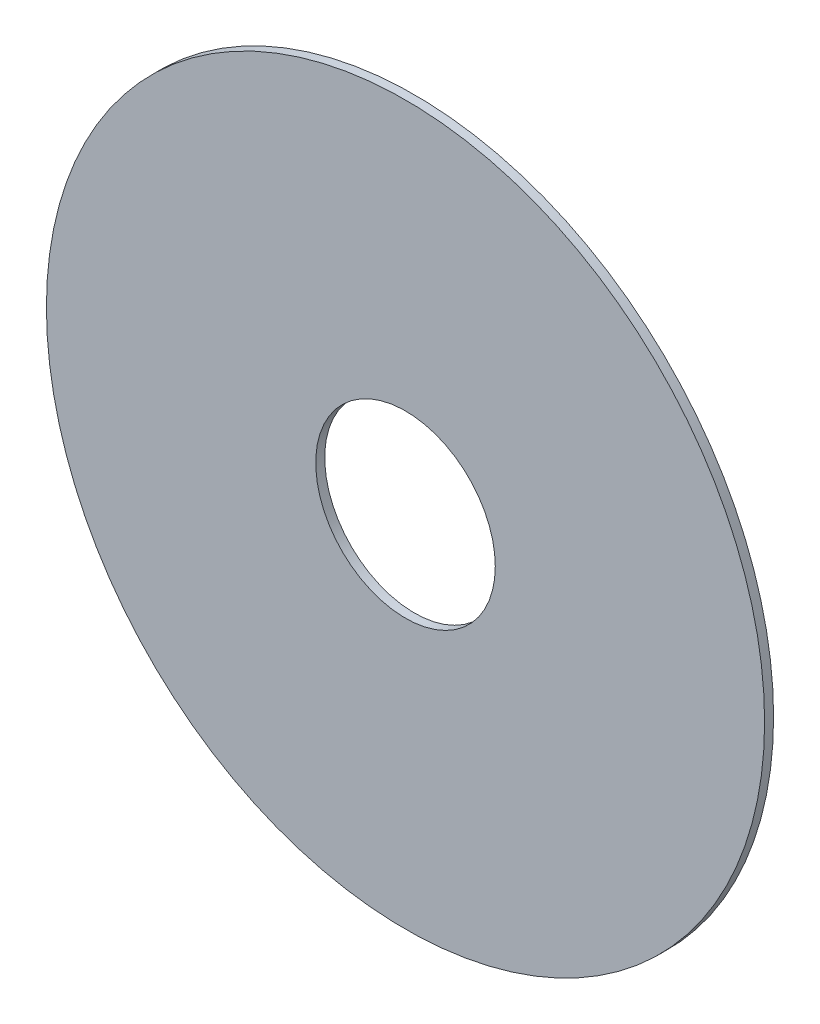
ISO-10303-21;
HEADER;
FILE_DESCRIPTION(('STEP AP214'),'2;1');
FILE_NAME('part.step','',(''),(''),'','','');
FILE_SCHEMA(('AUTOMOTIVE_DESIGN { 1 0 10303 214 1 1 1 1 }'));
ENDSEC;
DATA;
#1=APPLICATION_CONTEXT('core data for automotive mechanical design processes');
#2=APPLICATION_PROTOCOL_DEFINITION('international standard','automotive_design',2000,#1);
#3=PRODUCT_CONTEXT('',#1,'mechanical');
#4=PRODUCT('Part','Part','',(#3));
#5=PRODUCT_RELATED_PRODUCT_CATEGORY('part','',(#4));
#6=PRODUCT_DEFINITION_FORMATION('','',#4);
#7=PRODUCT_DEFINITION_CONTEXT('part definition',#1,'design');
#8=PRODUCT_DEFINITION('design','',#6,#7);
#9=PRODUCT_DEFINITION_SHAPE('','',#8);
#10=(LENGTH_UNIT() NAMED_UNIT(*) SI_UNIT(.MILLI.,.METRE.));
#11=(NAMED_UNIT(*) PLANE_ANGLE_UNIT() SI_UNIT($,.RADIAN.));
#12=(NAMED_UNIT(*) SI_UNIT($,.STERADIAN.) SOLID_ANGLE_UNIT());
#13=UNCERTAINTY_MEASURE_WITH_UNIT(LENGTH_MEASURE(1.E-05),#10,'distance_accuracy_value','');
#14=(GEOMETRIC_REPRESENTATION_CONTEXT(3) GLOBAL_UNCERTAINTY_ASSIGNED_CONTEXT((#13)) GLOBAL_UNIT_ASSIGNED_CONTEXT((#10,
#11,#12)) REPRESENTATION_CONTEXT('',''));
#15=CARTESIAN_POINT('',(0.,0.,0.));
#16=DIRECTION('',(0.,0.,1.));
#17=DIRECTION('',(1.,0.,0.));
#18=AXIS2_PLACEMENT_3D('',#15,#16,#17);
#19=CARTESIAN_POINT('',(0.,0.,0.5));
#20=DIRECTION('',(0.,0.,1.));
#21=DIRECTION('',(1.,0.,0.));
#22=AXIS2_PLACEMENT_3D('',#19,#20,#21);
#23=PLANE('',#22);
#24=CARTESIAN_POINT('',(0.,0.,0.5));
#25=DIRECTION('',(0.,0.,1.));
#26=DIRECTION('',(1.,0.,0.));
#27=AXIS2_PLACEMENT_3D('',#24,#25,#26);
#28=CIRCLE('',#27,5.);
#29=CARTESIAN_POINT('',(5.,0.,0.5));
#30=VERTEX_POINT('',#29);
#31=EDGE_CURVE('E27',#30,#30,#28,.F.);
#32=ORIENTED_EDGE('',*,*,#31,.T.);
#33=EDGE_LOOP('',(#32));
#34=FACE_BOUND('',#33,.T.);
#35=CARTESIAN_POINT('',(0.,0.,0.5));
#36=DIRECTION('',(0.,0.,1.));
#37=DIRECTION('',(1.,0.,0.));
#38=AXIS2_PLACEMENT_3D('',#35,#36,#37);
#39=CIRCLE('',#38,20.);
#40=CARTESIAN_POINT('',(20.,0.,0.5));
#41=VERTEX_POINT('',#40);
#42=EDGE_CURVE('E18',#41,#41,#39,.F.);
#43=ORIENTED_EDGE('',*,*,#42,.F.);
#44=EDGE_LOOP('',(#43));
#45=FACE_BOUND('',#44,.T.);
#46=ADVANCED_FACE('F15',(#34,#45),#23,.T.);
#47=CARTESIAN_POINT('',(0.,0.,0.));
#48=DIRECTION('',(0.,0.,1.));
#49=DIRECTION('',(1.,0.,0.));
#50=AXIS2_PLACEMENT_3D('',#47,#48,#49);
#51=CYLINDRICAL_SURFACE('',#50,20.);
#52=ORIENTED_EDGE('',*,*,#42,.T.);
#53=EDGE_LOOP('',(#52));
#54=FACE_BOUND('',#53,.T.);
#55=CARTESIAN_POINT('',(0.,0.,0.));
#56=DIRECTION('',(0.,0.,1.));
#57=DIRECTION('',(1.,0.,0.));
#58=AXIS2_PLACEMENT_3D('',#55,#56,#57);
#59=CIRCLE('',#58,20.);
#60=CARTESIAN_POINT('',(20.,0.,0.));
#61=VERTEX_POINT('',#60);
#62=EDGE_CURVE('E22',#61,#61,#59,.T.);
#63=ORIENTED_EDGE('',*,*,#62,.T.);
#64=EDGE_LOOP('',(#63));
#65=FACE_BOUND('',#64,.T.);
#66=ADVANCED_FACE('F35',(#54,#65),#51,.T.);
#67=CARTESIAN_POINT('',(0.,0.,0.));
#68=DIRECTION('',(0.,0.,1.));
#69=DIRECTION('',(1.,0.,0.));
#70=AXIS2_PLACEMENT_3D('',#67,#68,#69);
#71=CYLINDRICAL_SURFACE('',#70,5.);
#72=ORIENTED_EDGE('',*,*,#31,.F.);
#73=EDGE_LOOP('',(#72));
#74=FACE_BOUND('',#73,.T.);
#75=CARTESIAN_POINT('',(0.,0.,0.));
#76=DIRECTION('',(0.,0.,1.));
#77=DIRECTION('',(1.,0.,0.));
#78=AXIS2_PLACEMENT_3D('',#75,#76,#77);
#79=CIRCLE('',#78,5.);
#80=CARTESIAN_POINT('',(5.,0.,0.));
#81=VERTEX_POINT('',#80);
#82=EDGE_CURVE('E10',#81,#81,#79,.F.);
#83=ORIENTED_EDGE('',*,*,#82,.T.);
#84=EDGE_LOOP('',(#83));
#85=FACE_BOUND('',#84,.T.);
#86=ADVANCED_FACE('F43',(#74,#85),#71,.F.);
#87=CARTESIAN_POINT('',(0.,0.,0.));
#88=DIRECTION('',(0.,0.,1.));
#89=DIRECTION('',(1.,0.,0.));
#90=AXIS2_PLACEMENT_3D('',#87,#88,#89);
#91=PLANE('',#90);
#92=ORIENTED_EDGE('',*,*,#82,.F.);
#93=EDGE_LOOP('',(#92));
#94=FACE_BOUND('',#93,.T.);
#95=ORIENTED_EDGE('',*,*,#62,.F.);
#96=EDGE_LOOP('',(#95));
#97=FACE_BOUND('',#96,.T.);
#98=ADVANCED_FACE('F44',(#94,#97),#91,.F.);
#99=CLOSED_SHELL('',(#46,#66,#86,#98));
#100=MANIFOLD_SOLID_BREP('B1',#99);
#101=ADVANCED_BREP_SHAPE_REPRESENTATION('',(#18,#100),#14);
#102=SHAPE_DEFINITION_REPRESENTATION(#9,#101);
ENDSEC;
END-ISO-10303-21;
